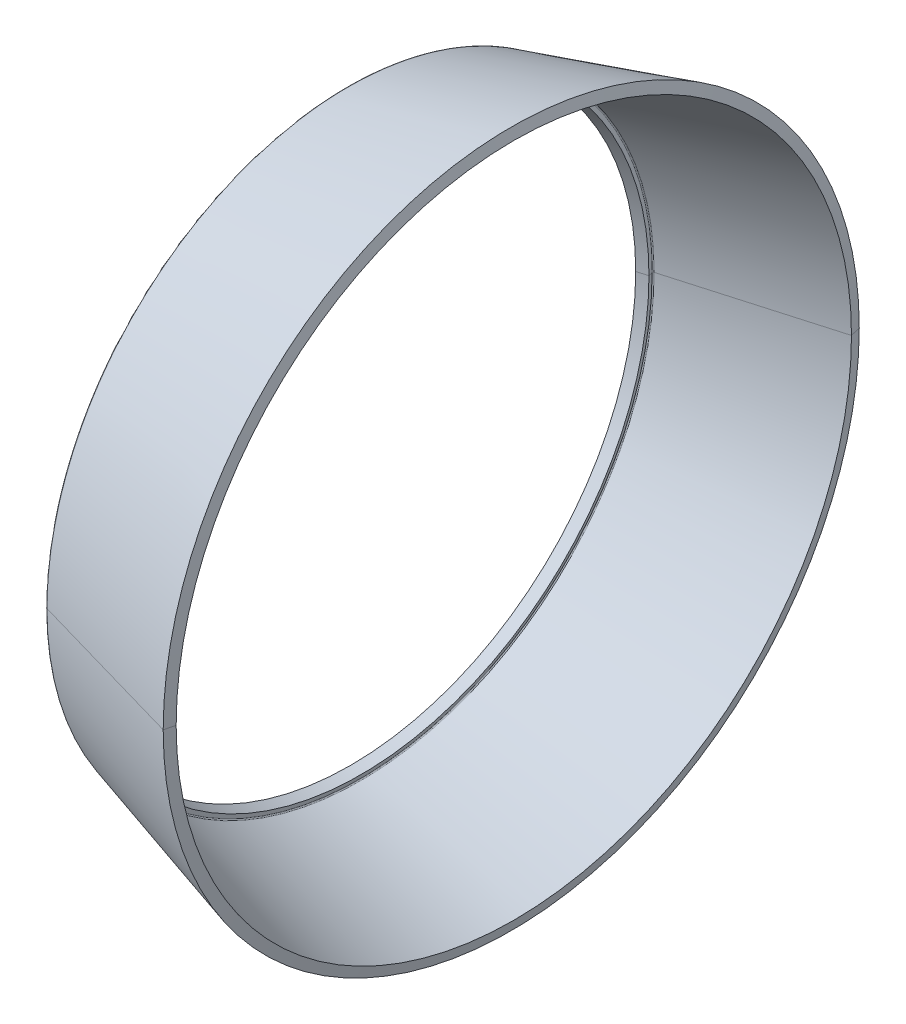
ISO-10303-21;
HEADER;
FILE_DESCRIPTION(('STEP AP214'),'2;1');
FILE_NAME('part.step','',(''),(''),'','','');
FILE_SCHEMA(('AUTOMOTIVE_DESIGN { 1 0 10303 214 1 1 1 1 }'));
ENDSEC;
DATA;
#1=APPLICATION_CONTEXT('core data for automotive mechanical design processes');
#2=APPLICATION_PROTOCOL_DEFINITION('international standard','automotive_design',2000,#1);
#3=PRODUCT_CONTEXT('',#1,'mechanical');
#4=PRODUCT('Part','Part','',(#3));
#5=PRODUCT_RELATED_PRODUCT_CATEGORY('part','',(#4));
#6=PRODUCT_DEFINITION_FORMATION('','',#4);
#7=PRODUCT_DEFINITION_CONTEXT('part definition',#1,'design');
#8=PRODUCT_DEFINITION('design','',#6,#7);
#9=PRODUCT_DEFINITION_SHAPE('','',#8);
#10=(LENGTH_UNIT() NAMED_UNIT(*) SI_UNIT(.MILLI.,.METRE.));
#11=(NAMED_UNIT(*) PLANE_ANGLE_UNIT() SI_UNIT($,.RADIAN.));
#12=(NAMED_UNIT(*) SI_UNIT($,.STERADIAN.) SOLID_ANGLE_UNIT());
#13=UNCERTAINTY_MEASURE_WITH_UNIT(LENGTH_MEASURE(1.E-05),#10,'distance_accuracy_value','');
#14=(GEOMETRIC_REPRESENTATION_CONTEXT(3) GLOBAL_UNCERTAINTY_ASSIGNED_CONTEXT((#13)) GLOBAL_UNIT_ASSIGNED_CONTEXT((#10,
#11,#12)) REPRESENTATION_CONTEXT('',''));
#15=CARTESIAN_POINT('',(0.,0.,0.));
#16=DIRECTION('',(0.,0.,1.));
#17=DIRECTION('',(1.,0.,0.));
#18=AXIS2_PLACEMENT_3D('',#15,#16,#17);
#19=CARTESIAN_POINT('',(15.065241397456,0.,0.));
#20=DIRECTION('',(1.,0.,0.));
#21=DIRECTION('',(0.,1.,0.));
#22=AXIS2_PLACEMENT_3D('',#19,#20,#21);
#23=CONICAL_SURFACE('',#22,32.545792137953,0.279985718604922);
#24=DIRECTION('',(0.961059384956962,0.,0.276341923323526));
#25=VECTOR('',#24,1.);
#26=CARTESIAN_POINT('',(-0.181939992354392,0.,28.161634929279));
#27=LINE('',#26,#25);
#28=CARTESIAN_POINT('',(-0.181939992354392,0.,28.161634929279));
#29=VERTEX_POINT('',#28);
#30=CARTESIAN_POINT('',(15.065241397456,0.,32.545792137953));
#31=VERTEX_POINT('',#30);
#32=EDGE_CURVE('E11',#29,#31,#27,.T.);
#33=ORIENTED_EDGE('',*,*,#32,.F.);
#34=CARTESIAN_POINT('',(-0.181939992354399,0.,0.));
#35=DIRECTION('',(1.,0.,0.));
#36=DIRECTION('',(0.,0.,-1.));
#37=AXIS2_PLACEMENT_3D('',#34,#35,#36);
#38=CIRCLE('',#37,28.161634929279);
#39=CARTESIAN_POINT('',(-0.1819399923544,-26.783306409016,-8.70242378253033));
#40=VERTEX_POINT('',#39);
#41=EDGE_CURVE('E25',#29,#40,#38,.T.);
#42=ORIENTED_EDGE('',*,*,#41,.T.);
#43=CARTESIAN_POINT('',(-0.181939992354399,0.,0.));
#44=DIRECTION('',(1.,0.,0.));
#45=DIRECTION('',(0.,0.,-1.));
#46=AXIS2_PLACEMENT_3D('',#43,#44,#45);
#47=CIRCLE('',#46,28.161634929279);
#48=CARTESIAN_POINT('',(-0.181939992354399,0.,-28.161634929279));
#49=VERTEX_POINT('',#48);
#50=EDGE_CURVE('E385',#40,#49,#47,.T.);
#51=ORIENTED_EDGE('',*,*,#50,.T.);
#52=DIRECTION('',(0.961059384956962,0.,-0.276341923323526));
#53=VECTOR('',#52,1.);
#54=CARTESIAN_POINT('',(-0.181939992354392,0.,-28.161634929279));
#55=LINE('',#54,#53);
#56=CARTESIAN_POINT('',(15.065241397456,0.,-32.545792137953));
#57=VERTEX_POINT('',#56);
#58=EDGE_CURVE('E125',#49,#57,#55,.T.);
#59=ORIENTED_EDGE('',*,*,#58,.T.);
#60=CARTESIAN_POINT('',(15.065241397456,0.,0.));
#61=DIRECTION('',(1.,0.,0.));
#62=DIRECTION('',(0.,0.,-1.));
#63=AXIS2_PLACEMENT_3D('',#60,#61,#62);
#64=CIRCLE('',#63,32.545792137953);
#65=EDGE_CURVE('E377',#31,#57,#64,.T.);
#66=ORIENTED_EDGE('',*,*,#65,.F.);
#67=EDGE_LOOP('',(#33,#42,#51,#59,#66));
#68=FACE_BOUND('',#67,.T.);
#69=ADVANCED_FACE('F17',(#68),#23,.T.);
#70=CARTESIAN_POINT('',(15.307921622528,0.,0.));
#71=DIRECTION('',(-1.,0.,0.));
#72=DIRECTION('',(0.,1.,0.));
#73=AXIS2_PLACEMENT_3D('',#70,#71,#72);
#74=CONICAL_SURFACE('',#73,31.575053706537,1.3258219129854);
#75=DIRECTION('',(-0.242531502590774,0.,-0.970143530747416));
#76=VECTOR('',#75,1.);
#77=CARTESIAN_POINT('',(15.307921622528,0.,-31.575053706537));
#78=LINE('',#77,#76);
#79=CARTESIAN_POINT('',(15.307921622528,0.,-31.575053706537));
#80=VERTEX_POINT('',#79);
#81=EDGE_CURVE('E372',#80,#57,#78,.T.);
#82=ORIENTED_EDGE('',*,*,#81,.F.);
#83=CARTESIAN_POINT('',(15.307921622528,0.,0.));
#84=DIRECTION('',(1.,0.,0.));
#85=DIRECTION('',(0.,0.,-1.));
#86=AXIS2_PLACEMENT_3D('',#83,#84,#85);
#87=CIRCLE('',#86,31.575053706537);
#88=CARTESIAN_POINT('',(15.307921622528,0.,31.575053706537));
#89=VERTEX_POINT('',#88);
#90=EDGE_CURVE('E367',#89,#80,#87,.T.);
#91=ORIENTED_EDGE('',*,*,#90,.F.);
#92=DIRECTION('',(-0.242531502590774,0.,0.970143530747416));
#93=VECTOR('',#92,1.);
#94=CARTESIAN_POINT('',(15.307921622528,0.,31.575053706537));
#95=LINE('',#94,#93);
#96=EDGE_CURVE('E362',#89,#31,#95,.T.);
#97=ORIENTED_EDGE('',*,*,#96,.T.);
#98=ORIENTED_EDGE('',*,*,#65,.T.);
#99=EDGE_LOOP('',(#82,#91,#97,#98));
#100=FACE_BOUND('',#99,.T.);
#101=ADVANCED_FACE('F426',(#100),#74,.T.);
#102=CARTESIAN_POINT('',(15.307921622528,0.,0.));
#103=DIRECTION('',(-1.,0.,0.));
#104=DIRECTION('',(0.,-1.,0.));
#105=AXIS2_PLACEMENT_3D('',#102,#103,#104);
#106=CONICAL_SURFACE('',#105,31.575053706537,1.3258219129854);
#107=ORIENTED_EDGE('',*,*,#81,.T.);
#108=CARTESIAN_POINT('',(15.065241397456,0.,0.));
#109=DIRECTION('',(1.,0.,0.));
#110=DIRECTION('',(0.,0.,-1.));
#111=AXIS2_PLACEMENT_3D('',#108,#109,#110);
#112=CIRCLE('',#111,32.545792137953);
#113=EDGE_CURVE('E357',#57,#31,#112,.T.);
#114=ORIENTED_EDGE('',*,*,#113,.T.);
#115=ORIENTED_EDGE('',*,*,#96,.F.);
#116=CARTESIAN_POINT('',(15.307921622528,0.,0.));
#117=DIRECTION('',(1.,0.,0.));
#118=DIRECTION('',(0.,0.,-1.));
#119=AXIS2_PLACEMENT_3D('',#116,#117,#118);
#120=CIRCLE('',#119,31.575053706537);
#121=EDGE_CURVE('E352',#80,#89,#120,.T.);
#122=ORIENTED_EDGE('',*,*,#121,.F.);
#123=EDGE_LOOP('',(#107,#114,#115,#122));
#124=FACE_BOUND('',#123,.T.);
#125=ADVANCED_FACE('F430',(#124),#106,.T.);
#126=CARTESIAN_POINT('',(0.97598959701984,0.,0.));
#127=DIRECTION('',(1.,0.,0.));
#128=DIRECTION('',(0.,-1.,0.));
#129=AXIS2_PLACEMENT_3D('',#126,#127,#128);
#130=CONICAL_SURFACE('',#129,27.454066259909,0.27998571860497);
#131=DIRECTION('',(0.961059384956949,0.,0.276341923323572));
#132=VECTOR('',#131,1.);
#133=CARTESIAN_POINT('',(0.975989597019826,0.,27.454066259909));
#134=LINE('',#133,#132);
#135=CARTESIAN_POINT('',(0.975989597019826,0.,27.454066259909));
#136=VERTEX_POINT('',#135);
#137=EDGE_CURVE('E340',#136,#89,#134,.T.);
#138=ORIENTED_EDGE('',*,*,#137,.F.);
#139=CARTESIAN_POINT('',(0.97598959701984,0.,0.));
#140=DIRECTION('',(1.,0.,0.));
#141=DIRECTION('',(0.,0.,-1.));
#142=AXIS2_PLACEMENT_3D('',#139,#140,#141);
#143=CIRCLE('',#142,27.454066259909);
#144=CARTESIAN_POINT('',(0.975989597019835,26.1103686152854,8.48377303900774));
#145=VERTEX_POINT('',#144);
#146=EDGE_CURVE('E337',#145,#136,#143,.T.);
#147=ORIENTED_EDGE('',*,*,#146,.F.);
#148=CARTESIAN_POINT('',(0.97598959701984,0.,0.));
#149=DIRECTION('',(1.,0.,0.));
#150=DIRECTION('',(0.,0.,-1.));
#151=AXIS2_PLACEMENT_3D('',#148,#149,#150);
#152=CIRCLE('',#151,27.454066259909);
#153=CARTESIAN_POINT('',(0.97598959701984,0.,-27.454066259909));
#154=VERTEX_POINT('',#153);
#155=EDGE_CURVE('E330',#154,#145,#152,.T.);
#156=ORIENTED_EDGE('',*,*,#155,.F.);
#157=DIRECTION('',(0.961059384956949,0.,-0.276341923323572));
#158=VECTOR('',#157,1.);
#159=CARTESIAN_POINT('',(0.975989597019826,0.,-27.454066259909));
#160=LINE('',#159,#158);
#161=EDGE_CURVE('E338',#154,#80,#160,.T.);
#162=ORIENTED_EDGE('',*,*,#161,.T.);
#163=ORIENTED_EDGE('',*,*,#121,.T.);
#164=EDGE_LOOP('',(#138,#147,#156,#162,#163));
#165=FACE_BOUND('',#164,.T.);
#166=ADVANCED_FACE('F435',(#165),#130,.F.);
#167=CARTESIAN_POINT('',(0.97598959701984,0.,0.));
#168=DIRECTION('',(1.,0.,0.));
#169=DIRECTION('',(0.,1.,0.));
#170=AXIS2_PLACEMENT_3D('',#167,#168,#169);
#171=CONICAL_SURFACE('',#170,27.454066259909,0.27998571860497);
#172=ORIENTED_EDGE('',*,*,#137,.T.);
#173=ORIENTED_EDGE('',*,*,#90,.T.);
#174=ORIENTED_EDGE('',*,*,#161,.F.);
#175=CARTESIAN_POINT('',(0.97598959701984,0.,0.));
#176=DIRECTION('',(1.,0.,0.));
#177=DIRECTION('',(0.,0.,-1.));
#178=AXIS2_PLACEMENT_3D('',#175,#176,#177);
#179=CIRCLE('',#178,27.454066259909);
#180=CARTESIAN_POINT('',(0.975989597019835,-26.1103686152854,-8.48377303900773));
#181=VERTEX_POINT('',#180);
#182=EDGE_CURVE('E333',#181,#154,#179,.T.);
#183=ORIENTED_EDGE('',*,*,#182,.F.);
#184=CARTESIAN_POINT('',(0.97598959701984,0.,0.));
#185=DIRECTION('',(1.,0.,0.));
#186=DIRECTION('',(0.,0.,-1.));
#187=AXIS2_PLACEMENT_3D('',#184,#185,#186);
#188=CIRCLE('',#187,27.454066259909);
#189=EDGE_CURVE('E447',#136,#181,#188,.T.);
#190=ORIENTED_EDGE('',*,*,#189,.F.);
#191=EDGE_LOOP('',(#172,#173,#174,#183,#190));
#192=FACE_BOUND('',#191,.T.);
#193=ADVANCED_FACE('F301',(#192),#171,.F.);
#194=CARTESIAN_POINT('',(1.00362378935138,0.,0.));
#195=DIRECTION('',(1.,0.,0.));
#196=DIRECTION('',(0.,0.309016994374947,-0.951056516295154));
#197=AXIS2_PLACEMENT_3D('',#194,#195,#196);
#198=TOROIDAL_SURFACE('',#197,27.3579603214137,0.0999999999993637);
#199=CARTESIAN_POINT('',(1.00362378935138,-26.0189664362248,-8.45407467075234));
#200=DIRECTION('',(0.,0.309016994374952,-0.951056516295152));
#201=DIRECTION('',(-0.27634192331722,-0.914021790611655,-0.296983682555801));
#202=AXIS2_PLACEMENT_3D('',#199,#200,#201);
#203=CIRCLE('',#202,0.0999999999993674);
#204=CARTESIAN_POINT('',(0.906609436277464,-25.9959003196296,-8.44658003515495));
#205=VERTEX_POINT('',#204);
#206=EDGE_CURVE('E448',#181,#205,#203,.T.);
#207=ORIENTED_EDGE('',*,*,#206,.T.);
#208=CARTESIAN_POINT('',(0.906609436277464,0.,0.));
#209=DIRECTION('',(1.,0.,0.));
#210=DIRECTION('',(0.,0.,1.));
#211=AXIS2_PLACEMENT_3D('',#208,#209,#210);
#212=CIRCLE('',#211,27.333707171154);
#213=CARTESIAN_POINT('',(0.906609436277463,0.,27.333707171154));
#214=VERTEX_POINT('',#213);
#215=EDGE_CURVE('E267',#214,#205,#212,.T.);
#216=ORIENTED_EDGE('',*,*,#215,.F.);
#217=CARTESIAN_POINT('',(0.906609436277464,0.,0.));
#218=DIRECTION('',(1.,0.,0.));
#219=DIRECTION('',(0.,0.951056516295156,0.309016994374939));
#220=AXIS2_PLACEMENT_3D('',#217,#218,#219);
#221=CIRCLE('',#220,27.333707171154);
#222=CARTESIAN_POINT('',(0.906609436277464,25.9959003196296,8.44658003515495));
#223=VERTEX_POINT('',#222);
#224=EDGE_CURVE('E242',#223,#214,#221,.T.);
#225=ORIENTED_EDGE('',*,*,#224,.F.);
#226=CARTESIAN_POINT('',(1.00362378935138,26.0189664362248,8.45407467075234));
#227=DIRECTION('',(0.,-0.309016994374952,0.951056516295152));
#228=DIRECTION('',(-0.276341923317219,0.914021790611655,0.296983682555801));
#229=AXIS2_PLACEMENT_3D('',#226,#227,#228);
#230=CIRCLE('',#229,0.0999999999993674);
#231=EDGE_CURVE('E324',#145,#223,#230,.T.);
#232=ORIENTED_EDGE('',*,*,#231,.F.);
#233=ORIENTED_EDGE('',*,*,#146,.T.);
#234=ORIENTED_EDGE('',*,*,#189,.T.);
#235=EDGE_LOOP('',(#207,#216,#225,#232,#233,#234));
#236=FACE_BOUND('',#235,.T.);
#237=ADVANCED_FACE('F296',(#236),#198,.F.);
#238=CARTESIAN_POINT('',(1.00362378935138,0.,0.));
#239=DIRECTION('',(1.,0.,0.));
#240=DIRECTION('',(0.,-0.309016994374947,0.951056516295154));
#241=AXIS2_PLACEMENT_3D('',#238,#239,#240);
#242=TOROIDAL_SURFACE('',#241,27.3579603214137,0.0999999999993637);
#243=ORIENTED_EDGE('',*,*,#206,.F.);
#244=ORIENTED_EDGE('',*,*,#182,.T.);
#245=ORIENTED_EDGE('',*,*,#155,.T.);
#246=ORIENTED_EDGE('',*,*,#231,.T.);
#247=CARTESIAN_POINT('',(0.906609436277461,0.,0.));
#248=DIRECTION('',(1.,0.,0.));
#249=DIRECTION('',(0.,0.,-1.));
#250=AXIS2_PLACEMENT_3D('',#247,#248,#249);
#251=CIRCLE('',#250,27.333707171154);
#252=CARTESIAN_POINT('',(0.906609436277461,0.,-27.333707171154));
#253=VERTEX_POINT('',#252);
#254=EDGE_CURVE('E326',#253,#223,#251,.T.);
#255=ORIENTED_EDGE('',*,*,#254,.F.);
#256=CARTESIAN_POINT('',(0.906609436277464,0.,0.));
#257=DIRECTION('',(1.,0.,0.));
#258=DIRECTION('',(0.,-0.951056516295153,-0.30901699437495));
#259=AXIS2_PLACEMENT_3D('',#256,#257,#258);
#260=CIRCLE('',#259,27.333707171154);
#261=EDGE_CURVE('E256',#205,#253,#260,.T.);
#262=ORIENTED_EDGE('',*,*,#261,.F.);
#263=EDGE_LOOP('',(#243,#244,#245,#246,#255,#262));
#264=FACE_BOUND('',#263,.T.);
#265=ADVANCED_FACE('F287',(#264),#242,.F.);
#266=CARTESIAN_POINT('',(1.0045310078665,0.,0.));
#267=DIRECTION('',(-1.,0.,0.));
#268=DIRECTION('',(0.,1.,0.));
#269=AXIS2_PLACEMENT_3D('',#266,#267,#268);
#270=CONICAL_SURFACE('',#269,26.942013810981,1.32582191298505);
#271=DIRECTION('',(-0.242531502591111,0.,-0.970143530747331));
#272=VECTOR('',#271,1.);
#273=CARTESIAN_POINT('',(1.0045310078665,0.,-26.942013810981));
#274=LINE('',#273,#272);
#275=CARTESIAN_POINT('',(1.0045310078665,0.,-26.942013810981));
#276=VERTEX_POINT('',#275);
#277=EDGE_CURVE('E276',#276,#253,#274,.T.);
#278=ORIENTED_EDGE('',*,*,#277,.F.);
#279=CARTESIAN_POINT('',(1.0045310078665,0.,0.));
#280=DIRECTION('',(1.,0.,0.));
#281=DIRECTION('',(0.,0.,-1.));
#282=AXIS2_PLACEMENT_3D('',#279,#280,#281);
#283=CIRCLE('',#282,26.942013810981);
#284=CARTESIAN_POINT('',(1.0045310078665,0.,26.942013810981));
#285=VERTEX_POINT('',#284);
#286=EDGE_CURVE('E270',#285,#276,#283,.T.);
#287=ORIENTED_EDGE('',*,*,#286,.F.);
#288=DIRECTION('',(-0.242531502591111,0.,0.970143530747331));
#289=VECTOR('',#288,1.);
#290=CARTESIAN_POINT('',(1.0045310078665,0.,26.942013810981));
#291=LINE('',#290,#289);
#292=EDGE_CURVE('E268',#285,#214,#291,.T.);
#293=ORIENTED_EDGE('',*,*,#292,.T.);
#294=ORIENTED_EDGE('',*,*,#215,.T.);
#295=ORIENTED_EDGE('',*,*,#261,.T.);
#296=EDGE_LOOP('',(#278,#287,#293,#294,#295));
#297=FACE_BOUND('',#296,.T.);
#298=ADVANCED_FACE('F222',(#297),#270,.T.);
#299=CARTESIAN_POINT('',(1.0045310078665,0.,0.));
#300=DIRECTION('',(-1.,0.,0.));
#301=DIRECTION('',(0.,-1.,0.));
#302=AXIS2_PLACEMENT_3D('',#299,#300,#301);
#303=CONICAL_SURFACE('',#302,26.942013810981,1.32582191298505);
#304=ORIENTED_EDGE('',*,*,#277,.T.);
#305=ORIENTED_EDGE('',*,*,#254,.T.);
#306=ORIENTED_EDGE('',*,*,#224,.T.);
#307=ORIENTED_EDGE('',*,*,#292,.F.);
#308=CARTESIAN_POINT('',(1.0045310078665,0.,0.));
#309=DIRECTION('',(1.,0.,0.));
#310=DIRECTION('',(0.,0.,-1.));
#311=AXIS2_PLACEMENT_3D('',#308,#309,#310);
#312=CIRCLE('',#311,26.942013810981);
#313=EDGE_CURVE('E271',#276,#285,#312,.T.);
#314=ORIENTED_EDGE('',*,*,#313,.F.);
#315=EDGE_LOOP('',(#304,#305,#306,#307,#314));
#316=FACE_BOUND('',#315,.T.);
#317=ADVANCED_FACE('F217',(#316),#303,.T.);
#318=CARTESIAN_POINT('',(0.0428822927199881,0.,0.));
#319=DIRECTION('',(1.,0.,0.));
#320=DIRECTION('',(0.,-1.,0.));
#321=AXIS2_PLACEMENT_3D('',#318,#319,#320);
#322=CONICAL_SURFACE('',#321,26.665502432325,0.279985718604474);
#323=DIRECTION('',(0.961059384957087,0.,0.276341923323093));
#324=VECTOR('',#323,1.);
#325=CARTESIAN_POINT('',(0.0428822927199881,0.,26.665502432325));
#326=LINE('',#325,#324);
#327=CARTESIAN_POINT('',(0.0428822927199891,0.,26.665502432325));
#328=VERTEX_POINT('',#327);
#329=EDGE_CURVE('E413',#328,#285,#326,.T.);
#330=ORIENTED_EDGE('',*,*,#329,.F.);
#331=CARTESIAN_POINT('',(0.0428822927199881,0.,0.));
#332=DIRECTION('',(1.,0.,0.));
#333=DIRECTION('',(0.,0.,-1.));
#334=AXIS2_PLACEMENT_3D('',#331,#332,#333);
#335=CIRCLE('',#334,26.665502432325);
#336=CARTESIAN_POINT('',(0.0428822927199881,0.,-26.665502432325));
#337=VERTEX_POINT('',#336);
#338=EDGE_CURVE('E408',#337,#328,#335,.T.);
#339=ORIENTED_EDGE('',*,*,#338,.F.);
#340=DIRECTION('',(0.961059384957087,0.,-0.276341923323093));
#341=VECTOR('',#340,1.);
#342=CARTESIAN_POINT('',(0.0428822927199881,0.,-26.665502432325));
#343=LINE('',#342,#341);
#344=EDGE_CURVE('E399',#337,#276,#343,.T.);
#345=ORIENTED_EDGE('',*,*,#344,.T.);
#346=ORIENTED_EDGE('',*,*,#313,.T.);
#347=EDGE_LOOP('',(#330,#339,#345,#346));
#348=FACE_BOUND('',#347,.T.);
#349=ADVANCED_FACE('F213',(#348),#322,.F.);
#350=CARTESIAN_POINT('',(0.0428822927199881,0.,0.));
#351=DIRECTION('',(1.,0.,0.));
#352=DIRECTION('',(0.,1.,0.));
#353=AXIS2_PLACEMENT_3D('',#350,#351,#352);
#354=CONICAL_SURFACE('',#353,26.665502432325,0.279985718604474);
#355=ORIENTED_EDGE('',*,*,#329,.T.);
#356=ORIENTED_EDGE('',*,*,#286,.T.);
#357=ORIENTED_EDGE('',*,*,#344,.F.);
#358=CARTESIAN_POINT('',(0.0428822927199881,0.,0.));
#359=DIRECTION('',(1.,0.,0.));
#360=DIRECTION('',(0.,0.,-1.));
#361=AXIS2_PLACEMENT_3D('',#358,#359,#360);
#362=CIRCLE('',#361,26.665502432325);
#363=EDGE_CURVE('E398',#328,#337,#362,.T.);
#364=ORIENTED_EDGE('',*,*,#363,.F.);
#365=EDGE_LOOP('',(#355,#356,#357,#364));
#366=FACE_BOUND('',#365,.T.);
#367=ADVANCED_FACE('F209',(#366),#354,.F.);
#368=CARTESIAN_POINT('',(-0.28601023346797,0.,0.));
#369=DIRECTION('',(-1.,0.,0.));
#370=DIRECTION('',(0.,1.,0.));
#371=AXIS2_PLACEMENT_3D('',#368,#369,#370);
#372=CONICAL_SURFACE('',#371,27.981096296147,1.32582191298505);
#373=DIRECTION('',(-0.242531502591111,0.,-0.970143530747331));
#374=VECTOR('',#373,1.);
#375=CARTESIAN_POINT('',(0.0428822927199891,0.,-26.665502432325));
#376=LINE('',#375,#374);
#377=CARTESIAN_POINT('',(-0.28601023346797,0.,-27.981096296147));
#378=VERTEX_POINT('',#377);
#379=EDGE_CURVE('E397',#337,#378,#376,.T.);
#380=ORIENTED_EDGE('',*,*,#379,.T.);
#381=CARTESIAN_POINT('',(-0.286010233467971,-26.6116039655328,-8.6466342767513));
#382=CARTESIAN_POINT('',(-0.286010233467971,-26.4984235256497,-8.99498073199024));
#383=CARTESIAN_POINT('',(-0.286010233467971,-26.3783959950325,-9.34110214781976));
#384=CARTESIAN_POINT('',(-0.286010233467971,-26.1248482342831,-10.0283672598289));
#385=CARTESIAN_POINT('',(-0.286010233467971,-25.9913280041509,-10.3695109560085));
#386=CARTESIAN_POINT('',(-0.286010233467971,-25.7109963263243,-11.0462929878867));
#387=CARTESIAN_POINT('',(-0.286010233467971,-25.56418487863,-11.3819313235854));
#388=CARTESIAN_POINT('',(-0.286010233467971,-25.2574983163463,-12.0471855391234));
#389=CARTESIAN_POINT('',(-0.286010233467971,-25.097623201757,-12.3768014189627));
#390=CARTESIAN_POINT('',(-0.286010233467971,-24.7650555058629,-13.0295023625336));
#391=CARTESIAN_POINT('',(-0.286010233467971,-24.5923629245582,-13.3525874262651));
#392=CARTESIAN_POINT('',(-0.286010233467971,-24.2344266592572,-13.9917285950732));
#393=CARTESIAN_POINT('',(-0.286010233467971,-24.049182975261,-14.3077847001498));
#394=CARTESIAN_POINT('',(-0.286010233467971,-23.6664301142479,-14.9323806076812));
#395=CARTESIAN_POINT('',(-0.286010233467971,-23.468920937231,-15.2409204101361));
#396=CARTESIAN_POINT('',(-0.286010233467971,-23.0619416410841,-15.8500079686525));
#397=CARTESIAN_POINT('',(-0.286010233467971,-22.8524715219543,-16.1505557247139));
#398=CARTESIAN_POINT('',(-0.286010233467971,-22.4218933276954,-16.7431957669875));
#399=CARTESIAN_POINT('',(-0.286010233467971,-22.2007852525665,-17.0352880531996));
#400=CARTESIAN_POINT('',(-0.286010233467971,-21.7472720793711,-17.6105667708012));
#401=CARTESIAN_POINT('',(-0.286010233467971,-21.5148669813046,-17.8937532021907));
#402=CARTESIAN_POINT('',(-0.286010233467971,-21.0391181139336,-18.4507835571525));
#403=CARTESIAN_POINT('',(-0.286010233467971,-20.7957743446291,-18.7246274807248));
#404=CARTESIAN_POINT('',(-0.286010233467971,-20.2985233532675,-19.2625505725824));
#405=CARTESIAN_POINT('',(-0.286010233467971,-20.0446161312104,-19.5266297408675));
#406=CARTESIAN_POINT('',(-0.286010233467971,-19.5266297408683,-20.044616131211));
#407=CARTESIAN_POINT('',(-0.286010233467971,-19.2625505725833,-20.2985233532693));
#408=CARTESIAN_POINT('',(-0.286010233467971,-18.7246274807241,-20.795774344627));
#409=CARTESIAN_POINT('',(-0.286010233467971,-18.4507835571499,-21.0391181139264));
#410=CARTESIAN_POINT('',(-0.286010233467971,-17.8937532021934,-21.5148669813117));
#411=CARTESIAN_POINT('',(-0.286010233467971,-17.6105667708111,-21.7472720793976));
#412=CARTESIAN_POINT('',(-0.286010233467971,-17.0352880531899,-22.2007852525398));
#413=CARTESIAN_POINT('',(-0.286010233467971,-16.743195766951,-22.4218933275961));
#414=CARTESIAN_POINT('',(-0.286010233467971,-16.1505557247507,-22.8524715220535));
#415=CARTESIAN_POINT('',(-0.286010233467971,-15.8500079687892,-23.0619416414546));
#416=CARTESIAN_POINT('',(-0.286010233467971,-15.2409204099995,-23.4689209368604));
#417=CARTESIAN_POINT('',(-0.286010233467971,-14.9323806071712,-23.666430112865));
#418=CARTESIAN_POINT('',(-0.286010233467971,-14.3077847006601,-24.0491829766439));
#419=CARTESIAN_POINT('',(-0.286010233467971,-13.9917285969773,-24.2344266644181));
#420=CARTESIAN_POINT('',(-0.286010233467971,-13.3525874243612,-24.5923629193972));
#421=CARTESIAN_POINT('',(-0.286010233467971,-13.0295023554277,-24.7650554866019));
#422=CARTESIAN_POINT('',(-0.286010233467971,-12.3768014260687,-25.0976232210179));
#423=CARTESIAN_POINT('',(-0.286010233467971,-12.0471855656431,-25.2574983882291));
#424=CARTESIAN_POINT('',(-0.286010233467971,-11.3819312970658,-25.5641848067471));
#425=CARTESIAN_POINT('',(-0.286010233467971,-11.0462928889142,-25.7109960580539));
#426=CARTESIAN_POINT('',(-0.286010233467971,-10.3695110549813,-25.9913282724212));
#427=CARTESIAN_POINT('',(-0.286010233467971,-10.0283676292,-26.1248492354818));
#428=CARTESIAN_POINT('',(-0.286010233467971,-9.34110177844883,-26.3783949938338));
#429=CARTESIAN_POINT('',(-0.286010233467971,-8.99497935347889,-26.4984197891253));
#430=CARTESIAN_POINT('',(-0.286010233467971,-8.29828920002392,-26.7247881419402));
#431=CARTESIAN_POINT('',(-0.286010233467971,-7.94772147153888,-26.8311316994635));
#432=CARTESIAN_POINT('',(-0.286010233467971,-7.24268126114949,-27.0299736044173));
#433=CARTESIAN_POINT('',(-0.286010233467971,-6.88820877924513,-27.1224719518477));
#434=CARTESIAN_POINT('',(-0.286010233467971,-6.17590563263739,-27.2934808044006));
#435=CARTESIAN_POINT('',(-0.286010233467971,-5.81807496793399,-27.3719913095231));
#436=CARTESIAN_POINT('',(-0.286010233467971,-5.09960720562544,-27.5149034440895));
#437=CARTESIAN_POINT('',(-0.286010233467971,-4.73897010802027,-27.5793050735335));
#438=CARTESIAN_POINT('',(-0.286010233467971,-4.01544555263381,-27.6939000640149));
#439=CARTESIAN_POINT('',(-0.286010233467971,-3.6525580948525,-27.7440934250523));
#440=CARTESIAN_POINT('',(-0.286010233467971,-2.92509237848021,-27.8301948203915));
#441=CARTESIAN_POINT('',(-0.286010233467971,-2.56051411988921,-27.8661028546933));
#442=CARTESIAN_POINT('',(-0.286010233467971,-1.83022890584988,-27.9235769742762));
#443=CARTESIAN_POINT('',(-0.286010233467971,-1.46452195040153,-27.9451430595573));
#444=CARTESIAN_POINT('',(-0.286010233467971,-0.732543420245661,-27.9739047103583));
#445=CARTESIAN_POINT('',(-0.286010233467971,-0.366271845538137,-27.9811002758781));
#446=CARTESIAN_POINT('',(-0.286010233467971,-1.13388189372162E-13,-27.981096296147));
#447=B_SPLINE_CURVE_WITH_KNOTS('',3,(#381,#382,#383,#384,#385,#386,#387,#388,#389,#390,#391,
#392,#393,#394,#395,#396,#397,#398,#399,#400,#401,#402,#403,#404,#405,#406,#407,#408,#409,#410,
#411,#412,#413,#414,#415,#416,#417,#418,#419,#420,#421,#422,#423,#424,#425,#426,#427,#428,#429,
#430,#431,#432,#433,#434,#435,#436,#437,#438,#439,#440,#441,#442,#443,#444,#445,#446),
.UNSPECIFIED.,.F.,.F.,(4,2,2,2,2,2,2,2,2,2,2,2,2,2,2,2,2,2,2,2,2,2,2,2,2,2,2,2,2,2,2,2,4),(0.,
1.09874447877955,2.1974889575591,3.29623343633865,4.3949779151182,5.49372239389775,
6.59246687267729,7.69121135145684,8.78995583023639,9.88870030901595,10.9874447877955,
12.086189266575,13.1849337453546,14.2836782241341,15.3824227029137,16.4811671816932,
17.5799116604728,18.6786561392523,19.7774006180319,20.8761450968114,21.974889575591,
23.0736340543705,24.1723785331501,25.2711230119296,26.3698674907092,27.4686119694887,
28.5673564482683,29.6661009270478,30.7648454058274,31.8635898846069,32.9623343633865,
34.061078842166,35.1598233209456),.UNSPECIFIED.);
#448=CARTESIAN_POINT('',(-0.286010233467971,-26.6116039655328,-8.64663427675131));
#449=VERTEX_POINT('',#448);
#450=EDGE_CURVE('E161',#449,#378,#447,.T.);
#451=ORIENTED_EDGE('',*,*,#450,.F.);
#452=CARTESIAN_POINT('',(-0.28601023346797,0.,0.));
#453=DIRECTION('',(1.,0.,0.));
#454=DIRECTION('',(0.,0.,-1.));
#455=AXIS2_PLACEMENT_3D('',#452,#453,#454);
#456=CIRCLE('',#455,27.981096296147);
#457=CARTESIAN_POINT('',(-0.286010233467969,0.,27.981096296147));
#458=VERTEX_POINT('',#457);
#459=EDGE_CURVE('E189',#458,#449,#456,.T.);
#460=ORIENTED_EDGE('',*,*,#459,.F.);
#461=DIRECTION('',(-0.242531502591111,0.,0.970143530747331));
#462=VECTOR('',#461,1.);
#463=CARTESIAN_POINT('',(0.042882292719989,0.,26.665502432325));
#464=LINE('',#463,#462);
#465=EDGE_CURVE('E187',#328,#458,#464,.T.);
#466=ORIENTED_EDGE('',*,*,#465,.F.);
#467=ORIENTED_EDGE('',*,*,#363,.T.);
#468=EDGE_LOOP('',(#380,#451,#460,#466,#467));
#469=FACE_BOUND('',#468,.T.);
#470=ADVANCED_FACE('F200',(#469),#372,.F.);
#471=CARTESIAN_POINT('',(-0.28601023346797,0.,0.));
#472=DIRECTION('',(-1.,0.,0.));
#473=DIRECTION('',(0.,-1.,0.));
#474=AXIS2_PLACEMENT_3D('',#471,#472,#473);
#475=CONICAL_SURFACE('',#474,27.981096296147,1.32582191298505);
#476=ORIENTED_EDGE('',*,*,#379,.F.);
#477=ORIENTED_EDGE('',*,*,#338,.T.);
#478=ORIENTED_EDGE('',*,*,#465,.T.);
#479=CARTESIAN_POINT('',(-0.286010233467971,26.6116039655328,8.64663427675132));
#480=CARTESIAN_POINT('',(-0.286010233467971,26.4984235256497,8.99498073199026));
#481=CARTESIAN_POINT('',(-0.286010233467971,26.3783959950325,9.34110214781977));
#482=CARTESIAN_POINT('',(-0.286010233467971,26.1248482342831,10.0283672598289));
#483=CARTESIAN_POINT('',(-0.286010233467971,25.9913280041509,10.3695109560085));
#484=CARTESIAN_POINT('',(-0.286010233467971,25.7109963263243,11.0462929878868));
#485=CARTESIAN_POINT('',(-0.286010233467971,25.56418487863,11.3819313235854));
#486=CARTESIAN_POINT('',(-0.286010233467971,25.2574983163463,12.0471855391234));
#487=CARTESIAN_POINT('',(-0.286010233467971,25.097623201757,12.3768014189627));
#488=CARTESIAN_POINT('',(-0.286010233467971,24.7650555058629,13.0295023625336));
#489=CARTESIAN_POINT('',(-0.286010233467971,24.5923629245582,13.3525874262651));
#490=CARTESIAN_POINT('',(-0.286010233467971,24.2344266592572,13.9917285950733));
#491=CARTESIAN_POINT('',(-0.286010233467971,24.049182975261,14.3077847001498));
#492=CARTESIAN_POINT('',(-0.286010233467971,23.6664301142479,14.9323806076813));
#493=CARTESIAN_POINT('',(-0.286010233467971,23.4689209372309,15.2409204101361));
#494=CARTESIAN_POINT('',(-0.286010233467971,23.0619416410841,15.8500079686525));
#495=CARTESIAN_POINT('',(-0.286010233467971,22.8524715219542,16.150555724714));
#496=CARTESIAN_POINT('',(-0.286010233467971,22.4218933276954,16.7431957669875));
#497=CARTESIAN_POINT('',(-0.286010233467971,22.2007852525664,17.0352880531996));
#498=CARTESIAN_POINT('',(-0.286010233467971,21.747272079371,17.6105667708012));
#499=CARTESIAN_POINT('',(-0.286010233467971,21.5148669813046,17.8937532021907));
#500=CARTESIAN_POINT('',(-0.286010233467971,21.0391181139336,18.4507835571525));
#501=CARTESIAN_POINT('',(-0.286010233467971,20.795774344629,18.7246274807248));
#502=CARTESIAN_POINT('',(-0.286010233467971,20.2985233532674,19.2625505725824));
#503=CARTESIAN_POINT('',(-0.286010233467971,20.0446161312104,19.5266297408676));
#504=CARTESIAN_POINT('',(-0.286010233467971,19.5266297408683,20.0446161312111));
#505=CARTESIAN_POINT('',(-0.286010233467971,19.2625505725832,20.2985233532694));
#506=CARTESIAN_POINT('',(-0.286010233467971,18.724627480724,20.7957743446271));
#507=CARTESIAN_POINT('',(-0.286010233467971,18.4507835571498,21.0391181139265));
#508=CARTESIAN_POINT('',(-0.286010233467971,17.8937532021934,21.5148669813118));
#509=CARTESIAN_POINT('',(-0.286010233467971,17.610566770811,21.7472720793976));
#510=CARTESIAN_POINT('',(-0.286010233467971,17.0352880531898,22.2007852525398));
#511=CARTESIAN_POINT('',(-0.286010233467971,16.7431957669509,22.4218933275961));
#512=CARTESIAN_POINT('',(-0.286010233467971,16.1505557247506,22.8524715220535));
#513=CARTESIAN_POINT('',(-0.286010233467971,15.8500079687892,23.0619416414547));
#514=CARTESIAN_POINT('',(-0.286010233467971,15.2409204099994,23.4689209368604));
#515=CARTESIAN_POINT('',(-0.286010233467971,14.9323806071711,23.666430112865));
#516=CARTESIAN_POINT('',(-0.286010233467971,14.30778470066,24.0491829766439));
#517=CARTESIAN_POINT('',(-0.286010233467971,13.9917285969773,24.2344266644182));
#518=CARTESIAN_POINT('',(-0.286010233467971,13.3525874243611,24.5923629193972));
#519=CARTESIAN_POINT('',(-0.286010233467971,13.0295023554277,24.765055486602));
#520=CARTESIAN_POINT('',(-0.286010233467971,12.3768014260686,25.0976232210179));
#521=CARTESIAN_POINT('',(-0.286010233467971,12.047185565643,25.2574983882292));
#522=CARTESIAN_POINT('',(-0.286010233467971,11.3819312970658,25.5641848067472));
#523=CARTESIAN_POINT('',(-0.286010233467971,11.0462928889141,25.7109960580539));
#524=CARTESIAN_POINT('',(-0.286010233467971,10.3695110549812,25.9913282724212));
#525=CARTESIAN_POINT('',(-0.286010233467971,10.0283676291999,26.1248492354818));
#526=CARTESIAN_POINT('',(-0.286010233467971,9.34110177844875,26.3783949938339));
#527=CARTESIAN_POINT('',(-0.286010233467971,8.99497935347881,26.4984197891254));
#528=CARTESIAN_POINT('',(-0.286010233467971,8.29828920002384,26.7247881419402));
#529=CARTESIAN_POINT('',(-0.286010233467971,7.9477214715388,26.8311316994636));
#530=CARTESIAN_POINT('',(-0.286010233467971,7.24268126114941,27.0299736044173));
#531=CARTESIAN_POINT('',(-0.286010233467971,6.88820877924505,27.1224719518477));
#532=CARTESIAN_POINT('',(-0.286010233467971,6.17590563263728,27.2934808044006));
#533=CARTESIAN_POINT('',(-0.286010233467971,5.81807496793389,27.3719913095231));
#534=CARTESIAN_POINT('',(-0.286010233467971,5.09960720562534,27.5149034440895));
#535=CARTESIAN_POINT('',(-0.286010233467971,4.73897010802018,27.5793050735335));
#536=CARTESIAN_POINT('',(-0.286010233467971,4.01544555263372,27.6939000640149));
#537=CARTESIAN_POINT('',(-0.286010233467971,3.65255809485242,27.7440934250523));
#538=CARTESIAN_POINT('',(-0.286010233467971,2.92509237848012,27.8301948203915));
#539=CARTESIAN_POINT('',(-0.286010233467971,2.56051411988912,27.8661028546933));
#540=CARTESIAN_POINT('',(-0.286010233467971,1.83022890584978,27.9235769742762));
#541=CARTESIAN_POINT('',(-0.286010233467971,1.46452195040143,27.9451430595574));
#542=CARTESIAN_POINT('',(-0.286010233467971,0.732543420245559,27.9739047103583));
#543=CARTESIAN_POINT('',(-0.286010233467971,0.366271845538032,27.9811002758781));
#544=CARTESIAN_POINT('',(-0.286010233467971,0.,27.981096296147));
#545=B_SPLINE_CURVE_WITH_KNOTS('',3,(#479,#480,#481,#482,#483,#484,#485,#486,#487,#488,#489,
#490,#491,#492,#493,#494,#495,#496,#497,#498,#499,#500,#501,#502,#503,#504,#505,#506,#507,#508,
#509,#510,#511,#512,#513,#514,#515,#516,#517,#518,#519,#520,#521,#522,#523,#524,#525,#526,#527,
#528,#529,#530,#531,#532,#533,#534,#535,#536,#537,#538,#539,#540,#541,#542,#543,#544),
.UNSPECIFIED.,.F.,.F.,(4,2,2,2,2,2,2,2,2,2,2,2,2,2,2,2,2,2,2,2,2,2,2,2,2,2,2,2,2,2,2,2,4),(0.,
1.09874447877955,2.1974889575591,3.29623343633866,4.39497791511821,5.49372239389776,
6.59246687267731,7.69121135145686,8.78995583023641,9.88870030901597,10.9874447877955,
12.0861892665751,13.1849337453546,14.2836782241342,15.3824227029137,16.4811671816933,
17.5799116604728,18.6786561392524,19.7774006180319,20.8761450968115,21.974889575591,
23.0736340543706,24.1723785331501,25.2711230119297,26.3698674907092,27.4686119694888,
28.5673564482684,29.6661009270479,30.7648454058275,31.863589884607,32.9623343633866,
34.0610788421661,35.1598233209457),.UNSPECIFIED.);
#546=CARTESIAN_POINT('',(-0.286010233467971,26.6116039655328,8.64663427675132));
#547=VERTEX_POINT('',#546);
#548=EDGE_CURVE('E186',#547,#458,#545,.T.);
#549=ORIENTED_EDGE('',*,*,#548,.F.);
#550=CARTESIAN_POINT('',(-0.286010233467971,0.,-27.981096296147));
#551=CARTESIAN_POINT('',(-0.286010233467971,0.549408691266494,-27.9811164241101));
#552=CARTESIAN_POINT('',(-0.286010233467971,1.09881532657469,-27.9649156222896));
#553=CARTESIAN_POINT('',(-0.286010233467971,2.19572392541619,-27.9002167131313));
#554=CARTESIAN_POINT('',(-0.286010233467971,2.74322588894949,-27.8517186057935));
#555=CARTESIAN_POINT('',(-0.286010233467971,3.83442458438295,-27.7225696396503));
#556=CARTESIAN_POINT('',(-0.286010233467971,4.37812131628311,-27.6419187808449));
#557=CARTESIAN_POINT('',(-0.286010233467971,5.45982395841199,-27.4487504155727));
#558=CARTESIAN_POINT('',(-0.286010233467971,5.9978298686407,-27.3362329091058));
#559=CARTESIAN_POINT('',(-0.286010233467971,7.06628454324155,-27.0797198471426));
#560=CARTESIAN_POINT('',(-0.286010233467971,7.59673330761368,-26.9357242916461));
#561=CARTESIAN_POINT('',(-0.286010233467971,8.64823370749236,-26.6167550759342));
#562=CARTESIAN_POINT('',(-0.286010233467971,9.16928534299892,-26.4417814157188));
#563=CARTESIAN_POINT('',(-0.286010233467971,10.2001840646497,-26.0614628135969));
#564=CARTESIAN_POINT('',(-0.286010233467971,10.7100311507938,-25.8561178716905));
#565=CARTESIAN_POINT('',(-0.286010233467971,11.7167522284611,-25.4157690352391));
#566=CARTESIAN_POINT('',(-0.286010233467971,12.2136262199843,-25.1807651406941));
#567=CARTESIAN_POINT('',(-0.286010233467971,13.192677561512,-24.6819135669259));
#568=CARTESIAN_POINT('',(-0.286010233467971,13.6748549115166,-24.4180658877027));
#569=CARTESIAN_POINT('',(-0.286010233467971,14.6228404031756,-23.8624419763811));
#570=CARTESIAN_POINT('',(-0.286010233467971,15.0886485448301,-23.5706657442827));
#571=CARTESIAN_POINT('',(-0.286010233467971,16.0022798339584,-22.9601968340324));
#572=CARTESIAN_POINT('',(-0.286010233467971,16.4501029814322,-22.6415041558804));
#573=CARTESIAN_POINT('',(-0.286010233467971,17.3262108823969,-21.9783078283617));
#574=CARTESIAN_POINT('',(-0.286010233467971,17.7544956358879,-21.633804178995));
#575=CARTESIAN_POINT('',(-0.286010233467971,18.5900411234553,-20.9201809162433));
#576=CARTESIAN_POINT('',(-0.286010233467971,18.9973018575317,-20.5510613028583));
#577=CARTESIAN_POINT('',(-0.286010233467971,19.7893866085322,-19.7894865066783));
#578=CARTESIAN_POINT('',(-0.286010233467971,20.1742106254562,-19.3970313238833));
#579=CARTESIAN_POINT('',(-0.286010233467971,20.9200870724402,-18.590146729424));
#580=CARTESIAN_POINT('',(-0.286010233467971,21.2811395025003,-18.1757173177597));
#581=CARTESIAN_POINT('',(-0.286010233467971,21.9782203644416,-17.3263218298642));
#582=CARTESIAN_POINT('',(-0.286010233467971,22.3142487963229,-16.891355753633));
#583=CARTESIAN_POINT('',(-0.286010233467971,22.9601160533267,-16.0023957380686));
#584=CARTESIAN_POINT('',(-0.286010233467971,23.2699548784493,-15.5484017987355));
#585=CARTESIAN_POINT('',(-0.286010233467971,23.8623681593306,-14.6229608618964));
#586=CARTESIAN_POINT('',(-0.286010233467971,24.1449426150893,-14.1515138643905));
#587=CARTESIAN_POINT('',(-0.286010233467971,24.681846968726,-13.192802156948));
#588=CARTESIAN_POINT('',(-0.286010233467971,24.9361768666038,-12.7055374470114));
#589=CARTESIAN_POINT('',(-0.286010233467971,25.4157098901126,-11.7168805286071));
#590=CARTESIAN_POINT('',(-0.286010233467971,25.6409130157435,-11.2154883201395));
#591=CARTESIAN_POINT('',(-0.286010233467971,26.0614113147316,-10.2003156237559));
#592=CARTESIAN_POINT('',(-0.286010233467971,26.2567064880889,-9.68653513584));
#593=CARTESIAN_POINT('',(-0.286010233467971,26.6167114466543,-8.64836807183949));
#594=CARTESIAN_POINT('',(-0.286010233467971,26.7814212318625,-8.12398149575491));
#595=CARTESIAN_POINT('',(-0.286010233467971,27.0796840720184,-7.06642123693342));
#596=CARTESIAN_POINT('',(-0.286010233467971,27.2132371269661,-6.5332475541965));
#597=CARTESIAN_POINT('',(-0.286010233467971,27.4487232410943,-5.45996254392143));
#598=CARTESIAN_POINT('',(-0.286010233467971,27.5506563002748,-4.91985121638328));
#599=CARTESIAN_POINT('',(-0.286010233467971,27.7225488372735,-3.83456444427077));
#600=CARTESIAN_POINT('',(-0.286010233467971,27.7925083150917,-3.28938899969642));
#601=CARTESIAN_POINT('',(-0.286010233467971,27.9002110238472,-2.19586508477253));
#602=CARTESIAN_POINT('',(-0.286010233467971,27.9379542547844,-1.64751661442301));
#603=CARTESIAN_POINT('',(-0.286010233467971,27.9810935151312,-0.549548756224153));
#604=CARTESIAN_POINT('',(-0.286010233467971,27.9864895445408,7.06316251789353E-05));
#605=CARTESIAN_POINT('',(-0.286010233467971,27.9649158024866,1.0986738471542));
#606=CARTESIAN_POINT('',(-0.286010233467971,27.9379460310228,1.64765767483389));
#607=CARTESIAN_POINT('',(-0.286010233467971,27.8517337979468,2.74308535090484));
#608=CARTESIAN_POINT('',(-0.286010233467971,27.7924913363345,3.2895291992961));
#609=CARTESIAN_POINT('',(-0.286010233467971,27.6419408695906,4.3779818534312));
#610=CARTESIAN_POINT('',(-0.286010233467971,27.5506328644591,4.91999065917504));
#611=CARTESIAN_POINT('',(-0.286010233467971,27.3362618891536,5.99769151438402));
#612=CARTESIAN_POINT('',(-0.286010233467971,27.2131989189798,6.53338356384916));
#613=CARTESIAN_POINT('',(-0.286010233467971,26.935767839814,7.59659869700499));
#614=CARTESIAN_POINT('',(-0.286010233467971,26.7813997308219,8.12412178069567));
#615=CARTESIAN_POINT('',(-0.286010233467971,26.6116039655328,8.64663427675123));
#616=B_SPLINE_CURVE_WITH_KNOTS('',3,(#550,#551,#552,#553,#554,#555,#556,#557,#558,#559,#560,
#561,#562,#563,#564,#565,#566,#567,#568,#569,#570,#571,#572,#573,#574,#575,#576,#577,#578,#579,
#580,#581,#582,#583,#584,#585,#586,#587,#588,#589,#590,#591,#592,#593,#594,#595,#596,#597,#598,
#599,#600,#601,#602,#603,#604,#605,#606,#607,#608,#609,#610,#611,#612,#613,#614,#615),
.UNSPECIFIED.,.F.,.F.,(4,2,2,2,2,2,2,2,2,2,2,2,2,2,2,2,2,2,2,2,2,2,2,2,2,2,2,2,2,2,2,2,4),(0.,
1.64798434279375,3.2959686855875,4.94395302838127,6.59193737117502,8.23992171396877,
9.88790605676251,11.5358903995563,13.18387474235,14.8318590851438,16.4798434279375,
18.1278277707313,19.775812113525,21.4237964563188,23.0717807991125,24.7197651419063,
26.3677494847,28.0157338274938,29.6637181702875,31.3117025130813,32.9596868558751,
34.6076711986688,36.2556555414626,37.9036398842563,39.5516242270501,41.1996085698438,
42.8475929126376,44.4955772554313,46.1435615982251,47.7915459410188,49.4395302838126,
51.0875146266064,52.7354989694001),.UNSPECIFIED.);
#617=EDGE_CURVE('E113',#378,#547,#616,.T.);
#618=ORIENTED_EDGE('',*,*,#617,.F.);
#619=EDGE_LOOP('',(#476,#477,#478,#549,#618));
#620=FACE_BOUND('',#619,.T.);
#621=ADVANCED_FACE('F147',(#620),#475,.F.);
#622=CARTESIAN_POINT('',(-0.140488703854917,0.,0.));
#623=DIRECTION('',(1.,0.,0.));
#624=DIRECTION('',(0.,-0.309016994374947,0.951056516295154));
#625=AXIS2_PLACEMENT_3D('',#622,#623,#624);
#626=TOROIDAL_SURFACE('',#625,28.017476021535,0.150000000000752);
#627=CARTESIAN_POINT('',(-0.140488703854917,-26.646203140424,-8.65787623014688));
#628=DIRECTION('',(0.,0.309016994374946,-0.951056516295154));
#629=DIRECTION('',(-0.276341923328505,-0.91402179060857,-0.296983682554793));
#630=AXIS2_PLACEMENT_3D('',#627,#628,#629);
#631=CIRCLE('',#630,0.150000000000751);
#632=EDGE_CURVE('E117',#40,#449,#631,.T.);
#633=ORIENTED_EDGE('',*,*,#632,.T.);
#634=ORIENTED_EDGE('',*,*,#450,.T.);
#635=ORIENTED_EDGE('',*,*,#617,.T.);
#636=CARTESIAN_POINT('',(-0.140488703854917,26.646203140424,8.65787623014689));
#637=DIRECTION('',(0.,-0.309016994374946,0.951056516295154));
#638=DIRECTION('',(-0.276341923328504,0.91402179060857,0.296983682554793));
#639=AXIS2_PLACEMENT_3D('',#636,#637,#638);
#640=CIRCLE('',#639,0.15000000000075);
#641=CARTESIAN_POINT('',(-0.1819399923544,26.783306409016,8.70242378253033));
#642=VERTEX_POINT('',#641);
#643=EDGE_CURVE('E103',#642,#547,#640,.T.);
#644=ORIENTED_EDGE('',*,*,#643,.F.);
#645=CARTESIAN_POINT('',(-0.181939992354399,0.,0.));
#646=DIRECTION('',(1.,0.,0.));
#647=DIRECTION('',(0.,0.,-1.));
#648=AXIS2_PLACEMENT_3D('',#645,#646,#647);
#649=CIRCLE('',#648,28.161634929279);
#650=EDGE_CURVE('E109',#49,#642,#649,.T.);
#651=ORIENTED_EDGE('',*,*,#650,.F.);
#652=ORIENTED_EDGE('',*,*,#50,.F.);
#653=EDGE_LOOP('',(#633,#634,#635,#644,#651,#652));
#654=FACE_BOUND('',#653,.T.);
#655=ADVANCED_FACE('F106',(#654),#626,.T.);
#656=CARTESIAN_POINT('',(15.065241397456,0.,0.));
#657=DIRECTION('',(1.,0.,0.));
#658=DIRECTION('',(0.,-1.,0.));
#659=AXIS2_PLACEMENT_3D('',#656,#657,#658);
#660=CONICAL_SURFACE('',#659,32.545792137953,0.279985718604922);
#661=ORIENTED_EDGE('',*,*,#32,.T.);
#662=ORIENTED_EDGE('',*,*,#113,.F.);
#663=ORIENTED_EDGE('',*,*,#58,.F.);
#664=ORIENTED_EDGE('',*,*,#650,.T.);
#665=CARTESIAN_POINT('',(-0.181939992354399,0.,0.));
#666=DIRECTION('',(1.,0.,0.));
#667=DIRECTION('',(0.,0.,-1.));
#668=AXIS2_PLACEMENT_3D('',#665,#666,#667);
#669=CIRCLE('',#668,28.161634929279);
#670=EDGE_CURVE('E119',#642,#29,#669,.T.);
#671=ORIENTED_EDGE('',*,*,#670,.T.);
#672=EDGE_LOOP('',(#661,#662,#663,#664,#671));
#673=FACE_BOUND('',#672,.T.);
#674=ADVANCED_FACE('F123',(#673),#660,.T.);
#675=CARTESIAN_POINT('',(-0.140488703854917,0.,0.));
#676=DIRECTION('',(1.,0.,0.));
#677=DIRECTION('',(0.,0.309016994374947,-0.951056516295154));
#678=AXIS2_PLACEMENT_3D('',#675,#676,#677);
#679=TOROIDAL_SURFACE('',#678,28.017476021535,0.150000000000752);
#680=ORIENTED_EDGE('',*,*,#632,.F.);
#681=ORIENTED_EDGE('',*,*,#41,.F.);
#682=ORIENTED_EDGE('',*,*,#670,.F.);
#683=ORIENTED_EDGE('',*,*,#643,.T.);
#684=ORIENTED_EDGE('',*,*,#548,.T.);
#685=ORIENTED_EDGE('',*,*,#459,.T.);
#686=EDGE_LOOP('',(#680,#681,#682,#683,#684,#685));
#687=FACE_BOUND('',#686,.T.);
#688=ADVANCED_FACE('F120',(#687),#679,.T.);
#689=CLOSED_SHELL('',(#69,#101,#125,#166,#193,#237,#265,#298,#317,#349,#367,#470,#621,#655,#674,#688));
#690=MANIFOLD_SOLID_BREP('B1',#689);
#691=ADVANCED_BREP_SHAPE_REPRESENTATION('',(#18,#690),#14);
#692=SHAPE_DEFINITION_REPRESENTATION(#9,#691);
ENDSEC;
END-ISO-10303-21;
